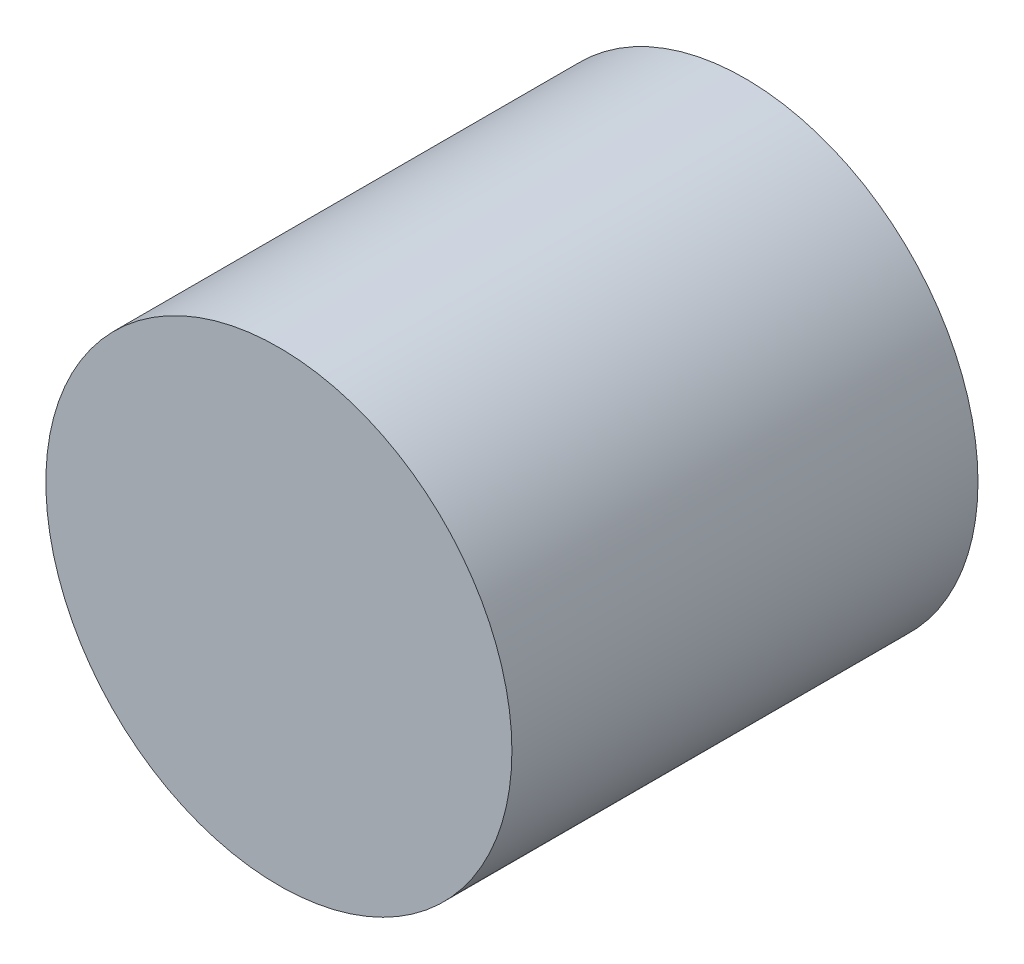
ISO-10303-21;
HEADER;
FILE_DESCRIPTION(('STEP AP214'),'2;1');
FILE_NAME('part.step','',(''),(''),'','','');
FILE_SCHEMA(('AUTOMOTIVE_DESIGN { 1 0 10303 214 1 1 1 1 }'));
ENDSEC;
DATA;
#1=APPLICATION_CONTEXT('core data for automotive mechanical design processes');
#2=APPLICATION_PROTOCOL_DEFINITION('international standard','automotive_design',2000,#1);
#3=PRODUCT_CONTEXT('',#1,'mechanical');
#4=PRODUCT('Part','Part','',(#3));
#5=PRODUCT_RELATED_PRODUCT_CATEGORY('part','',(#4));
#6=PRODUCT_DEFINITION_FORMATION('','',#4);
#7=PRODUCT_DEFINITION_CONTEXT('part definition',#1,'design');
#8=PRODUCT_DEFINITION('design','',#6,#7);
#9=PRODUCT_DEFINITION_SHAPE('','',#8);
#10=(LENGTH_UNIT() NAMED_UNIT(*) SI_UNIT(.MILLI.,.METRE.));
#11=(NAMED_UNIT(*) PLANE_ANGLE_UNIT() SI_UNIT($,.RADIAN.));
#12=(NAMED_UNIT(*) SI_UNIT($,.STERADIAN.) SOLID_ANGLE_UNIT());
#13=UNCERTAINTY_MEASURE_WITH_UNIT(LENGTH_MEASURE(1.E-05),#10,'distance_accuracy_value','');
#14=(GEOMETRIC_REPRESENTATION_CONTEXT(3) GLOBAL_UNCERTAINTY_ASSIGNED_CONTEXT((#13)) GLOBAL_UNIT_ASSIGNED_CONTEXT((#10,
#11,#12)) REPRESENTATION_CONTEXT('',''));
#15=CARTESIAN_POINT('',(0.,0.,0.));
#16=DIRECTION('',(0.,0.,1.));
#17=DIRECTION('',(1.,0.,0.));
#18=AXIS2_PLACEMENT_3D('',#15,#16,#17);
#19=CARTESIAN_POINT('',(0.,0.,7.5));
#20=DIRECTION('',(0.,0.,-1.));
#21=DIRECTION('',(-1.,0.,0.));
#22=AXIS2_PLACEMENT_3D('',#19,#20,#21);
#23=CYLINDRICAL_SURFACE('',#22,7.5);
#24=CARTESIAN_POINT('',(0.,0.,7.5));
#25=DIRECTION('',(0.,0.,1.));
#26=DIRECTION('',(1.,0.,0.));
#27=AXIS2_PLACEMENT_3D('',#24,#25,#26);
#28=CIRCLE('',#27,7.5);
#29=CARTESIAN_POINT('',(7.5,0.,7.5));
#30=VERTEX_POINT('',#29);
#31=EDGE_CURVE('E10',#30,#30,#28,.T.);
#32=ORIENTED_EDGE('',*,*,#31,.F.);
#33=EDGE_LOOP('',(#32));
#34=FACE_BOUND('',#33,.T.);
#35=CARTESIAN_POINT('',(0.,0.,-7.5));
#36=DIRECTION('',(0.,0.,1.));
#37=DIRECTION('',(1.,0.,0.));
#38=AXIS2_PLACEMENT_3D('',#35,#36,#37);
#39=CIRCLE('',#38,7.5);
#40=CARTESIAN_POINT('',(7.5,0.,-7.5));
#41=VERTEX_POINT('',#40);
#42=EDGE_CURVE('E36',#41,#41,#39,.T.);
#43=ORIENTED_EDGE('',*,*,#42,.T.);
#44=EDGE_LOOP('',(#43));
#45=FACE_BOUND('',#44,.T.);
#46=ADVANCED_FACE('F33',(#34,#45),#23,.T.);
#47=CARTESIAN_POINT('',(0.,0.,7.5));
#48=DIRECTION('',(0.,0.,1.));
#49=DIRECTION('',(1.,0.,0.));
#50=AXIS2_PLACEMENT_3D('',#47,#48,#49);
#51=PLANE('',#50);
#52=ORIENTED_EDGE('',*,*,#31,.T.);
#53=EDGE_LOOP('',(#52));
#54=FACE_BOUND('',#53,.T.);
#55=ADVANCED_FACE('F48',(#54),#51,.T.);
#56=CARTESIAN_POINT('',(0.,0.,-7.5));
#57=DIRECTION('',(0.,0.,1.));
#58=DIRECTION('',(1.,0.,0.));
#59=AXIS2_PLACEMENT_3D('',#56,#57,#58);
#60=PLANE('',#59);
#61=ORIENTED_EDGE('',*,*,#42,.F.);
#62=EDGE_LOOP('',(#61));
#63=FACE_BOUND('',#62,.T.);
#64=ADVANCED_FACE('F46',(#63),#60,.F.);
#65=CLOSED_SHELL('',(#46,#55,#64));
#66=MANIFOLD_SOLID_BREP('B2',#65);
#67=ADVANCED_BREP_SHAPE_REPRESENTATION('',(#18,#66),#14);
#68=SHAPE_DEFINITION_REPRESENTATION(#9,#67);
ENDSEC;
END-ISO-10303-21;
